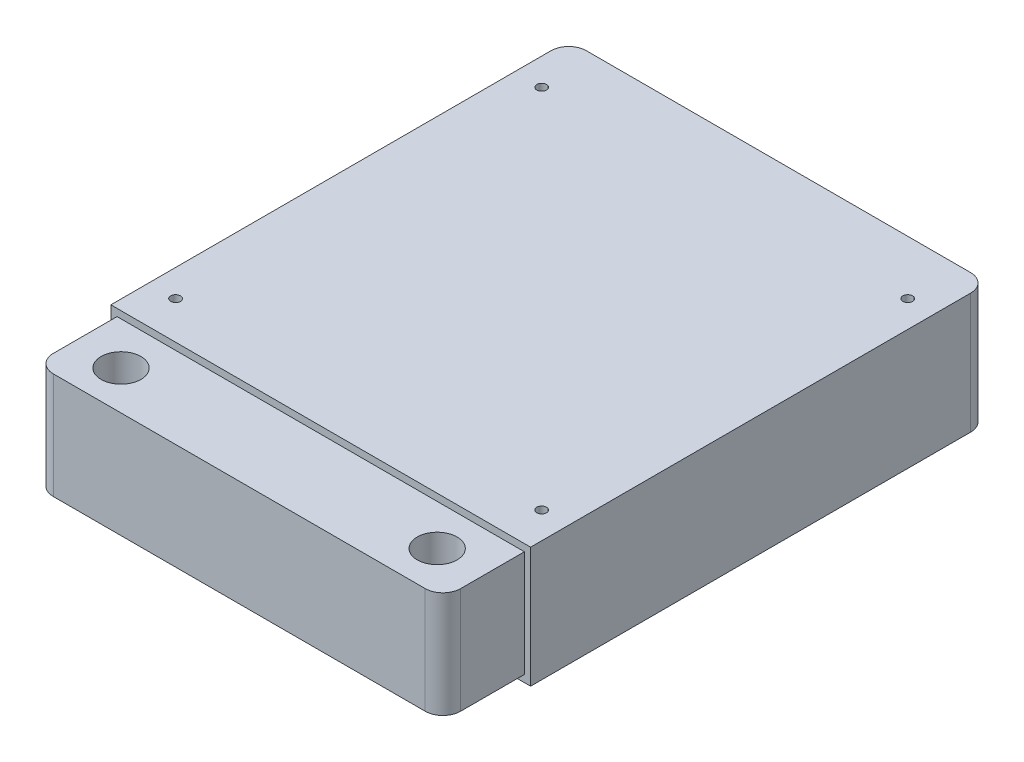
ISO-10303-21;
HEADER;
FILE_DESCRIPTION(('STEP AP214'),'2;1');
FILE_NAME('part.step','',(''),(''),'','','');
FILE_SCHEMA(('AUTOMOTIVE_DESIGN { 1 0 10303 214 1 1 1 1 }'));
ENDSEC;
DATA;
#1=APPLICATION_CONTEXT('core data for automotive mechanical design processes');
#2=APPLICATION_PROTOCOL_DEFINITION('international standard','automotive_design',2000,#1);
#3=PRODUCT_CONTEXT('',#1,'mechanical');
#4=PRODUCT('Part','Part','',(#3));
#5=PRODUCT_RELATED_PRODUCT_CATEGORY('part','',(#4));
#6=PRODUCT_DEFINITION_FORMATION('','',#4);
#7=PRODUCT_DEFINITION_CONTEXT('part definition',#1,'design');
#8=PRODUCT_DEFINITION('design','',#6,#7);
#9=PRODUCT_DEFINITION_SHAPE('','',#8);
#10=(LENGTH_UNIT() NAMED_UNIT(*) SI_UNIT(.MILLI.,.METRE.));
#11=(NAMED_UNIT(*) PLANE_ANGLE_UNIT() SI_UNIT($,.RADIAN.));
#12=(NAMED_UNIT(*) SI_UNIT($,.STERADIAN.) SOLID_ANGLE_UNIT());
#13=UNCERTAINTY_MEASURE_WITH_UNIT(LENGTH_MEASURE(1.E-05),#10,'distance_accuracy_value','');
#14=(GEOMETRIC_REPRESENTATION_CONTEXT(3) GLOBAL_UNCERTAINTY_ASSIGNED_CONTEXT((#13)) GLOBAL_UNIT_ASSIGNED_CONTEXT((#10,
#11,#12)) REPRESENTATION_CONTEXT('',''));
#15=CARTESIAN_POINT('',(0.,0.,0.));
#16=DIRECTION('',(0.,0.,1.));
#17=DIRECTION('',(1.,0.,0.));
#18=AXIS2_PLACEMENT_3D('',#15,#16,#17);
#19=CARTESIAN_POINT('',(-143.433647385571,34.544,12.0931673151752));
#20=DIRECTION('',(0.,0.,-1.));
#21=DIRECTION('',(-1.,0.,0.));
#22=AXIS2_PLACEMENT_3D('',#19,#20,#21);
#23=PLANE('',#22);
#24=DIRECTION('',(1.,0.,0.));
#25=VECTOR('',#24,1.);
#26=CARTESIAN_POINT('',(-143.433647385571,0.,12.0931673151752));
#27=LINE('',#26,#25);
#28=CARTESIAN_POINT('',(-143.433647385571,0.,12.0931673151752));
#29=VERTEX_POINT('',#28);
#30=CARTESIAN_POINT('',(-23.0376473855714,0.,12.0931673151752));
#31=VERTEX_POINT('',#30);
#32=EDGE_CURVE('E189',#29,#31,#27,.T.);
#33=ORIENTED_EDGE('',*,*,#32,.T.);
#34=DIRECTION('',(0.,-1.,0.));
#35=VECTOR('',#34,1.);
#36=CARTESIAN_POINT('',(-23.0376473855714,34.544,12.0931673151752));
#37=LINE('',#36,#35);
#38=CARTESIAN_POINT('',(-23.0376473855714,34.544,12.0931673151752));
#39=VERTEX_POINT('',#38);
#40=EDGE_CURVE('E196',#39,#31,#37,.T.);
#41=ORIENTED_EDGE('',*,*,#40,.F.);
#42=DIRECTION('',(1.,0.,0.));
#43=VECTOR('',#42,1.);
#44=CARTESIAN_POINT('',(-143.433647385571,34.544,12.0931673151752));
#45=LINE('',#44,#43);
#46=CARTESIAN_POINT('',(-143.433647385571,34.544,12.0931673151752));
#47=VERTEX_POINT('',#46);
#48=EDGE_CURVE('E194',#47,#39,#45,.T.);
#49=ORIENTED_EDGE('',*,*,#48,.F.);
#50=DIRECTION('',(0.,-1.,0.));
#51=VECTOR('',#50,1.);
#52=CARTESIAN_POINT('',(-143.433647385571,34.544,12.0931673151752));
#53=LINE('',#52,#51);
#54=EDGE_CURVE('E207',#47,#29,#53,.T.);
#55=ORIENTED_EDGE('',*,*,#54,.T.);
#56=EDGE_LOOP('',(#33,#41,#49,#55));
#57=FACE_BOUND('',#56,.T.);
#58=DIRECTION('',(0.,1.,0.));
#59=VECTOR('',#58,1.);
#60=CARTESIAN_POINT('',(-24.8156473855714,2.032,12.0931673151752));
#61=LINE('',#60,#59);
#62=CARTESIAN_POINT('',(-24.8156473855714,2.032,12.0931673151752));
#63=VERTEX_POINT('',#62);
#64=CARTESIAN_POINT('',(-24.8156473855714,32.512,12.0931673151752));
#65=VERTEX_POINT('',#64);
#66=EDGE_CURVE('E127',#63,#65,#61,.T.);
#67=ORIENTED_EDGE('',*,*,#66,.F.);
#68=DIRECTION('',(1.,0.,0.));
#69=VECTOR('',#68,1.);
#70=CARTESIAN_POINT('',(-141.655647385571,2.032,12.0931673151752));
#71=LINE('',#70,#69);
#72=CARTESIAN_POINT('',(-141.655647385571,2.032,12.0931673151752));
#73=VERTEX_POINT('',#72);
#74=EDGE_CURVE('E139',#73,#63,#71,.T.);
#75=ORIENTED_EDGE('',*,*,#74,.F.);
#76=DIRECTION('',(0.,-1.,0.));
#77=VECTOR('',#76,1.);
#78=CARTESIAN_POINT('',(-141.655647385571,2.032,12.0931673151752));
#79=LINE('',#78,#77);
#80=CARTESIAN_POINT('',(-141.655647385571,32.512,12.0931673151752));
#81=VERTEX_POINT('',#80);
#82=EDGE_CURVE('E148',#81,#73,#79,.T.);
#83=ORIENTED_EDGE('',*,*,#82,.F.);
#84=DIRECTION('',(-1.,0.,0.));
#85=VECTOR('',#84,1.);
#86=CARTESIAN_POINT('',(-141.655647385571,32.512,12.0931673151752));
#87=LINE('',#86,#85);
#88=EDGE_CURVE('E142',#65,#81,#87,.T.);
#89=ORIENTED_EDGE('',*,*,#88,.F.);
#90=EDGE_LOOP('',(#67,#75,#83,#89));
#91=FACE_BOUND('',#90,.T.);
#92=ADVANCED_FACE('F35',(#57,#91),#23,.F.);
#93=CARTESIAN_POINT('',(-23.0376473855714,34.544,-119.224832684825));
#94=DIRECTION('',(-1.,0.,0.));
#95=DIRECTION('',(0.,0.,1.));
#96=AXIS2_PLACEMENT_3D('',#93,#94,#95);
#97=PLANE('',#96);
#98=DIRECTION('',(0.,0.,-1.));
#99=VECTOR('',#98,1.);
#100=CARTESIAN_POINT('',(-23.0376473855714,0.,-119.224832684825));
#101=LINE('',#100,#99);
#102=CARTESIAN_POINT('',(-23.0376473855714,0.,-114.144832684825));
#103=VERTEX_POINT('',#102);
#104=EDGE_CURVE('E182',#31,#103,#101,.T.);
#105=ORIENTED_EDGE('',*,*,#104,.T.);
#106=DIRECTION('',(0.,-1.,0.));
#107=VECTOR('',#106,1.);
#108=CARTESIAN_POINT('',(-23.0376473855714,34.544,-114.144832684825));
#109=LINE('',#108,#107);
#110=CARTESIAN_POINT('',(-23.0376473855714,34.544,-114.144832684825));
#111=VERTEX_POINT('',#110);
#112=EDGE_CURVE('E226',#103,#111,#109,.F.);
#113=ORIENTED_EDGE('',*,*,#112,.T.);
#114=DIRECTION('',(0.,0.,-1.));
#115=VECTOR('',#114,1.);
#116=CARTESIAN_POINT('',(-23.0376473855714,34.544,-119.224832684825));
#117=LINE('',#116,#115);
#118=EDGE_CURVE('E185',#39,#111,#117,.T.);
#119=ORIENTED_EDGE('',*,*,#118,.F.);
#120=ORIENTED_EDGE('',*,*,#40,.T.);
#121=EDGE_LOOP('',(#105,#113,#119,#120));
#122=FACE_BOUND('',#121,.T.);
#123=ADVANCED_FACE('F287',(#122),#97,.F.);
#124=CARTESIAN_POINT('',(-143.433647385571,34.544,-119.224832684825));
#125=DIRECTION('',(0.,0.,1.));
#126=DIRECTION('',(1.,0.,0.));
#127=AXIS2_PLACEMENT_3D('',#124,#125,#126);
#128=PLANE('',#127);
#129=DIRECTION('',(-1.,0.,0.));
#130=VECTOR('',#129,1.);
#131=CARTESIAN_POINT('',(-143.433647385571,34.544,-119.224832684825));
#132=LINE('',#131,#130);
#133=CARTESIAN_POINT('',(-28.1176473855715,34.544,-119.224832684825));
#134=VERTEX_POINT('',#133);
#135=CARTESIAN_POINT('',(-138.353647385571,34.544,-119.224832684825));
#136=VERTEX_POINT('',#135);
#137=EDGE_CURVE('E188',#134,#136,#132,.T.);
#138=ORIENTED_EDGE('',*,*,#137,.F.);
#139=DIRECTION('',(0.,-1.,0.));
#140=VECTOR('',#139,1.);
#141=CARTESIAN_POINT('',(-28.1176473855714,34.544,-119.224832684825));
#142=LINE('',#141,#140);
#143=CARTESIAN_POINT('',(-28.1176473855715,0.,-119.224832684825));
#144=VERTEX_POINT('',#143);
#145=EDGE_CURVE('E219',#134,#144,#142,.T.);
#146=ORIENTED_EDGE('',*,*,#145,.T.);
#147=DIRECTION('',(-1.,0.,0.));
#148=VECTOR('',#147,1.);
#149=CARTESIAN_POINT('',(-143.433647385571,0.,-119.224832684825));
#150=LINE('',#149,#148);
#151=CARTESIAN_POINT('',(-138.353647385571,0.,-119.224832684825));
#152=VERTEX_POINT('',#151);
#153=EDGE_CURVE('E199',#144,#152,#150,.T.);
#154=ORIENTED_EDGE('',*,*,#153,.T.);
#155=DIRECTION('',(0.,-1.,0.));
#156=VECTOR('',#155,1.);
#157=CARTESIAN_POINT('',(-138.353647385571,34.544,-119.224832684825));
#158=LINE('',#157,#156);
#159=EDGE_CURVE('E210',#152,#136,#158,.F.);
#160=ORIENTED_EDGE('',*,*,#159,.T.);
#161=EDGE_LOOP('',(#138,#146,#154,#160));
#162=FACE_BOUND('',#161,.T.);
#163=ADVANCED_FACE('F293',(#162),#128,.F.);
#164=CARTESIAN_POINT('',(-143.433647385571,34.544,-119.224832684825));
#165=DIRECTION('',(1.,0.,0.));
#166=DIRECTION('',(0.,0.,-1.));
#167=AXIS2_PLACEMENT_3D('',#164,#165,#166);
#168=PLANE('',#167);
#169=DIRECTION('',(0.,0.,1.));
#170=VECTOR('',#169,1.);
#171=CARTESIAN_POINT('',(-143.433647385571,34.544,-119.224832684825));
#172=LINE('',#171,#170);
#173=CARTESIAN_POINT('',(-143.433647385571,34.544,-114.144832684825));
#174=VERTEX_POINT('',#173);
#175=EDGE_CURVE('E192',#174,#47,#172,.T.);
#176=ORIENTED_EDGE('',*,*,#175,.F.);
#177=DIRECTION('',(0.,-1.,0.));
#178=VECTOR('',#177,1.);
#179=CARTESIAN_POINT('',(-143.433647385571,34.544,-114.144832684825));
#180=LINE('',#179,#178);
#181=CARTESIAN_POINT('',(-143.433647385571,0.,-114.144832684825));
#182=VERTEX_POINT('',#181);
#183=EDGE_CURVE('E232',#174,#182,#180,.T.);
#184=ORIENTED_EDGE('',*,*,#183,.T.);
#185=DIRECTION('',(0.,0.,1.));
#186=VECTOR('',#185,1.);
#187=CARTESIAN_POINT('',(-143.433647385571,0.,-119.224832684825));
#188=LINE('',#187,#186);
#189=EDGE_CURVE('E202',#182,#29,#188,.T.);
#190=ORIENTED_EDGE('',*,*,#189,.T.);
#191=ORIENTED_EDGE('',*,*,#54,.F.);
#192=EDGE_LOOP('',(#176,#184,#190,#191));
#193=FACE_BOUND('',#192,.T.);
#194=ADVANCED_FACE('F300',(#193),#168,.F.);
#195=CARTESIAN_POINT('',(0.,34.544,0.));
#196=DIRECTION('',(0.,1.,0.));
#197=DIRECTION('',(0.,0.,1.));
#198=AXIS2_PLACEMENT_3D('',#195,#196,#197);
#199=PLANE('',#198);
#200=CARTESIAN_POINT('',(-30.6866473855714,34.544,-103.730832684825));
#201=DIRECTION('',(0.,1.,0.));
#202=DIRECTION('',(0.,0.,1.));
#203=AXIS2_PLACEMENT_3D('',#200,#201,#202);
#204=CIRCLE('',#203,1.397);
#205=CARTESIAN_POINT('',(-30.6866473855714,34.544,-102.333832684825));
#206=VERTEX_POINT('',#205);
#207=EDGE_CURVE('E165',#206,#206,#204,.T.);
#208=ORIENTED_EDGE('',*,*,#207,.F.);
#209=EDGE_LOOP('',(#208));
#210=FACE_BOUND('',#209,.T.);
#211=CARTESIAN_POINT('',(-135.686647385571,34.544,1.26916731517515));
#212=DIRECTION('',(0.,1.,0.));
#213=DIRECTION('',(0.,0.,1.));
#214=AXIS2_PLACEMENT_3D('',#211,#212,#213);
#215=CIRCLE('',#214,1.39700000000002);
#216=CARTESIAN_POINT('',(-135.686647385571,34.544,2.66616731517517));
#217=VERTEX_POINT('',#216);
#218=EDGE_CURVE('E171',#217,#217,#215,.T.);
#219=ORIENTED_EDGE('',*,*,#218,.F.);
#220=EDGE_LOOP('',(#219));
#221=FACE_BOUND('',#220,.T.);
#222=CARTESIAN_POINT('',(-30.6866473275714,34.544,1.26916731517515));
#223=DIRECTION('',(0.,1.,0.));
#224=DIRECTION('',(0.,0.,1.));
#225=AXIS2_PLACEMENT_3D('',#222,#223,#224);
#226=CIRCLE('',#225,1.397);
#227=CARTESIAN_POINT('',(-30.6866473275714,34.544,2.66616731517515));
#228=VERTEX_POINT('',#227);
#229=EDGE_CURVE('E160',#228,#228,#226,.T.);
#230=ORIENTED_EDGE('',*,*,#229,.F.);
#231=EDGE_LOOP('',(#230));
#232=FACE_BOUND('',#231,.T.);
#233=CARTESIAN_POINT('',(-135.686647385571,34.544,-103.730832684825));
#234=DIRECTION('',(0.,1.,0.));
#235=DIRECTION('',(0.,0.,1.));
#236=AXIS2_PLACEMENT_3D('',#233,#234,#235);
#237=CIRCLE('',#236,1.39700000000002);
#238=CARTESIAN_POINT('',(-135.686647385571,34.544,-102.333832684825));
#239=VERTEX_POINT('',#238);
#240=EDGE_CURVE('E164',#239,#239,#237,.T.);
#241=ORIENTED_EDGE('',*,*,#240,.F.);
#242=EDGE_LOOP('',(#241));
#243=FACE_BOUND('',#242,.T.);
#244=ORIENTED_EDGE('',*,*,#118,.T.);
#245=CARTESIAN_POINT('',(-28.1176473855714,34.544,-114.144832684825));
#246=DIRECTION('',(0.,1.,0.));
#247=DIRECTION('',(0.,0.,1.));
#248=AXIS2_PLACEMENT_3D('',#245,#246,#247);
#249=CIRCLE('',#248,5.08);
#250=EDGE_CURVE('E230',#111,#134,#249,.T.);
#251=ORIENTED_EDGE('',*,*,#250,.T.);
#252=ORIENTED_EDGE('',*,*,#137,.T.);
#253=CARTESIAN_POINT('',(-138.353647385571,34.544,-114.144832684825));
#254=DIRECTION('',(0.,1.,0.));
#255=DIRECTION('',(0.,0.,1.));
#256=AXIS2_PLACEMENT_3D('',#253,#254,#255);
#257=CIRCLE('',#256,5.08);
#258=EDGE_CURVE('E228',#136,#174,#257,.T.);
#259=ORIENTED_EDGE('',*,*,#258,.T.);
#260=ORIENTED_EDGE('',*,*,#175,.T.);
#261=ORIENTED_EDGE('',*,*,#48,.T.);
#262=EDGE_LOOP('',(#244,#251,#252,#259,#260,#261));
#263=FACE_BOUND('',#262,.T.);
#264=ADVANCED_FACE('F303',(#210,#221,#232,#243,#263),#199,.T.);
#265=CARTESIAN_POINT('',(0.,0.,0.));
#266=DIRECTION('',(0.,1.,0.));
#267=DIRECTION('',(0.,0.,1.));
#268=AXIS2_PLACEMENT_3D('',#265,#266,#267);
#269=PLANE('',#268);
#270=CARTESIAN_POINT('',(-30.6866473855714,0.,-103.730832684825));
#271=DIRECTION('',(0.,1.,0.));
#272=DIRECTION('',(0.,0.,1.));
#273=AXIS2_PLACEMENT_3D('',#270,#271,#272);
#274=CIRCLE('',#273,1.397);
#275=CARTESIAN_POINT('',(-30.6866473855714,0.,-102.333832684825));
#276=VERTEX_POINT('',#275);
#277=EDGE_CURVE('E161',#276,#276,#274,.T.);
#278=ORIENTED_EDGE('',*,*,#277,.T.);
#279=EDGE_LOOP('',(#278));
#280=FACE_BOUND('',#279,.T.);
#281=CARTESIAN_POINT('',(-135.686647385571,0.,1.26916731517515));
#282=DIRECTION('',(0.,1.,0.));
#283=DIRECTION('',(0.,0.,1.));
#284=AXIS2_PLACEMENT_3D('',#281,#282,#283);
#285=CIRCLE('',#284,1.39700000000002);
#286=CARTESIAN_POINT('',(-135.686647385571,0.,2.66616731517517));
#287=VERTEX_POINT('',#286);
#288=EDGE_CURVE('E168',#287,#287,#285,.T.);
#289=ORIENTED_EDGE('',*,*,#288,.T.);
#290=EDGE_LOOP('',(#289));
#291=FACE_BOUND('',#290,.T.);
#292=CARTESIAN_POINT('',(-30.6866473275714,0.,1.26916731517515));
#293=DIRECTION('',(0.,1.,0.));
#294=DIRECTION('',(0.,0.,1.));
#295=AXIS2_PLACEMENT_3D('',#292,#293,#294);
#296=CIRCLE('',#295,1.397);
#297=CARTESIAN_POINT('',(-30.6866473275714,0.,2.66616731517515));
#298=VERTEX_POINT('',#297);
#299=EDGE_CURVE('E174',#298,#298,#296,.T.);
#300=ORIENTED_EDGE('',*,*,#299,.T.);
#301=EDGE_LOOP('',(#300));
#302=FACE_BOUND('',#301,.T.);
#303=CARTESIAN_POINT('',(-135.686647385571,0.,-103.730832684825));
#304=DIRECTION('',(0.,1.,0.));
#305=DIRECTION('',(0.,0.,1.));
#306=AXIS2_PLACEMENT_3D('',#303,#304,#305);
#307=CIRCLE('',#306,1.39700000000002);
#308=CARTESIAN_POINT('',(-135.686647385571,0.,-102.333832684825));
#309=VERTEX_POINT('',#308);
#310=EDGE_CURVE('E179',#309,#309,#307,.T.);
#311=ORIENTED_EDGE('',*,*,#310,.T.);
#312=EDGE_LOOP('',(#311));
#313=FACE_BOUND('',#312,.T.);
#314=ORIENTED_EDGE('',*,*,#153,.F.);
#315=CARTESIAN_POINT('',(-28.1176473855714,0.,-114.144832684825));
#316=DIRECTION('',(0.,1.,0.));
#317=DIRECTION('',(0.,0.,1.));
#318=AXIS2_PLACEMENT_3D('',#315,#316,#317);
#319=CIRCLE('',#318,5.08);
#320=EDGE_CURVE('E224',#144,#103,#319,.F.);
#321=ORIENTED_EDGE('',*,*,#320,.T.);
#322=ORIENTED_EDGE('',*,*,#104,.F.);
#323=ORIENTED_EDGE('',*,*,#32,.F.);
#324=ORIENTED_EDGE('',*,*,#189,.F.);
#325=CARTESIAN_POINT('',(-138.353647385571,0.,-114.144832684825));
#326=DIRECTION('',(0.,1.,0.));
#327=DIRECTION('',(0.,0.,1.));
#328=AXIS2_PLACEMENT_3D('',#325,#326,#327);
#329=CIRCLE('',#328,5.08);
#330=EDGE_CURVE('E222',#182,#152,#329,.F.);
#331=ORIENTED_EDGE('',*,*,#330,.T.);
#332=EDGE_LOOP('',(#314,#321,#322,#323,#324,#331));
#333=FACE_BOUND('',#332,.T.);
#334=ADVANCED_FACE('F298',(#280,#291,#302,#313,#333),#269,.F.);
#335=CARTESIAN_POINT('',(-135.686647385571,0.,-103.730832684825));
#336=DIRECTION('',(0.,1.,0.));
#337=DIRECTION('',(0.,0.,1.));
#338=AXIS2_PLACEMENT_3D('',#335,#336,#337);
#339=CYLINDRICAL_SURFACE('',#338,1.39700000000002);
#340=ORIENTED_EDGE('',*,*,#310,.F.);
#341=EDGE_LOOP('',(#340));
#342=FACE_BOUND('',#341,.T.);
#343=ORIENTED_EDGE('',*,*,#240,.T.);
#344=EDGE_LOOP('',(#343));
#345=FACE_BOUND('',#344,.T.);
#346=ADVANCED_FACE('F383',(#342,#345),#339,.F.);
#347=CARTESIAN_POINT('',(-30.6866473275714,0.,1.26916731517515));
#348=DIRECTION('',(0.,1.,0.));
#349=DIRECTION('',(0.,0.,1.));
#350=AXIS2_PLACEMENT_3D('',#347,#348,#349);
#351=CYLINDRICAL_SURFACE('',#350,1.397);
#352=ORIENTED_EDGE('',*,*,#299,.F.);
#353=EDGE_LOOP('',(#352));
#354=FACE_BOUND('',#353,.T.);
#355=ORIENTED_EDGE('',*,*,#229,.T.);
#356=EDGE_LOOP('',(#355));
#357=FACE_BOUND('',#356,.T.);
#358=ADVANCED_FACE('F443',(#354,#357),#351,.F.);
#359=CARTESIAN_POINT('',(-135.686647385571,0.,1.26916731517515));
#360=DIRECTION('',(0.,1.,0.));
#361=DIRECTION('',(0.,0.,1.));
#362=AXIS2_PLACEMENT_3D('',#359,#360,#361);
#363=CYLINDRICAL_SURFACE('',#362,1.39700000000002);
#364=ORIENTED_EDGE('',*,*,#288,.F.);
#365=EDGE_LOOP('',(#364));
#366=FACE_BOUND('',#365,.T.);
#367=ORIENTED_EDGE('',*,*,#218,.T.);
#368=EDGE_LOOP('',(#367));
#369=FACE_BOUND('',#368,.T.);
#370=ADVANCED_FACE('F433',(#366,#369),#363,.F.);
#371=CARTESIAN_POINT('',(-30.6866473855714,0.,-103.730832684825));
#372=DIRECTION('',(0.,1.,0.));
#373=DIRECTION('',(0.,0.,1.));
#374=AXIS2_PLACEMENT_3D('',#371,#372,#373);
#375=CYLINDRICAL_SURFACE('',#374,1.397);
#376=ORIENTED_EDGE('',*,*,#277,.F.);
#377=EDGE_LOOP('',(#376));
#378=FACE_BOUND('',#377,.T.);
#379=ORIENTED_EDGE('',*,*,#207,.T.);
#380=EDGE_LOOP('',(#379));
#381=FACE_BOUND('',#380,.T.);
#382=ADVANCED_FACE('F372',(#378,#381),#375,.F.);
#383=CARTESIAN_POINT('',(-24.8156473855714,2.032,35.4611673151752));
#384=DIRECTION('',(-1.,0.,0.));
#385=DIRECTION('',(0.,0.,1.));
#386=AXIS2_PLACEMENT_3D('',#383,#384,#385);
#387=PLANE('',#386);
#388=DIRECTION('',(0.,0.,-1.));
#389=VECTOR('',#388,1.);
#390=CARTESIAN_POINT('',(-24.8156473855714,32.512,35.4611673151752));
#391=LINE('',#390,#389);
#392=CARTESIAN_POINT('',(-24.8156473855714,32.512,30.3811673151752));
#393=VERTEX_POINT('',#392);
#394=EDGE_CURVE('E158',#393,#65,#391,.T.);
#395=ORIENTED_EDGE('',*,*,#394,.F.);
#396=DIRECTION('',(0.,1.,0.));
#397=VECTOR('',#396,1.);
#398=CARTESIAN_POINT('',(-24.8156473855714,2.032,30.3811673151752));
#399=LINE('',#398,#397);
#400=CARTESIAN_POINT('',(-24.8156473855714,2.032,30.3811673151752));
#401=VERTEX_POINT('',#400);
#402=EDGE_CURVE('E11',#393,#401,#399,.F.);
#403=ORIENTED_EDGE('',*,*,#402,.T.);
#404=DIRECTION('',(0.,0.,-1.));
#405=VECTOR('',#404,1.);
#406=CARTESIAN_POINT('',(-24.8156473855714,2.032,35.4611673151752));
#407=LINE('',#406,#405);
#408=EDGE_CURVE('E124',#401,#63,#407,.T.);
#409=ORIENTED_EDGE('',*,*,#408,.T.);
#410=ORIENTED_EDGE('',*,*,#66,.T.);
#411=EDGE_LOOP('',(#395,#403,#409,#410));
#412=FACE_BOUND('',#411,.T.);
#413=ADVANCED_FACE('F126',(#412),#387,.F.);
#414=CARTESIAN_POINT('',(-141.655647385571,32.512,35.4611673151752));
#415=DIRECTION('',(0.,-1.,0.));
#416=DIRECTION('',(0.,0.,-1.));
#417=AXIS2_PLACEMENT_3D('',#414,#415,#416);
#418=PLANE('',#417);
#419=CARTESIAN_POINT('',(-38.1506473855714,32.512,23.7771673151752));
#420=DIRECTION('',(0.,1.,0.));
#421=DIRECTION('',(0.,0.,1.));
#422=AXIS2_PLACEMENT_3D('',#419,#420,#421);
#423=CIRCLE('',#422,5.715);
#424=CARTESIAN_POINT('',(-38.1506473855714,32.512,29.4921673151751));
#425=VERTEX_POINT('',#424);
#426=EDGE_CURVE('E217',#425,#425,#423,.T.);
#427=ORIENTED_EDGE('',*,*,#426,.F.);
#428=EDGE_LOOP('',(#427));
#429=FACE_BOUND('',#428,.T.);
#430=CARTESIAN_POINT('',(-128.320647385571,32.512,24.2881986543503));
#431=DIRECTION('',(0.,1.,0.));
#432=DIRECTION('',(0.,0.,1.));
#433=AXIS2_PLACEMENT_3D('',#430,#431,#432);
#434=CIRCLE('',#433,5.71499999999999);
#435=CARTESIAN_POINT('',(-128.320647385571,32.512,30.0031986543503));
#436=VERTEX_POINT('',#435);
#437=EDGE_CURVE('E213',#436,#436,#434,.T.);
#438=ORIENTED_EDGE('',*,*,#437,.F.);
#439=EDGE_LOOP('',(#438));
#440=FACE_BOUND('',#439,.T.);
#441=DIRECTION('',(0.,0.,-1.));
#442=VECTOR('',#441,1.);
#443=CARTESIAN_POINT('',(-141.655647385571,32.512,35.4611673151752));
#444=LINE('',#443,#442);
#445=CARTESIAN_POINT('',(-141.655647385571,32.512,30.3811673151752));
#446=VERTEX_POINT('',#445);
#447=EDGE_CURVE('E156',#446,#81,#444,.T.);
#448=ORIENTED_EDGE('',*,*,#447,.F.);
#449=CARTESIAN_POINT('',(-136.575647385571,32.512,30.3811673151752));
#450=DIRECTION('',(0.,-1.,0.));
#451=DIRECTION('',(0.,0.,-1.));
#452=AXIS2_PLACEMENT_3D('',#449,#450,#451);
#453=CIRCLE('',#452,5.08);
#454=CARTESIAN_POINT('',(-136.575647385571,32.512,35.4611673151752));
#455=VERTEX_POINT('',#454);
#456=EDGE_CURVE('E43',#446,#455,#453,.F.);
#457=ORIENTED_EDGE('',*,*,#456,.T.);
#458=DIRECTION('',(-1.,0.,0.));
#459=VECTOR('',#458,1.);
#460=CARTESIAN_POINT('',(-141.655647385571,32.512,35.4611673151752));
#461=LINE('',#460,#459);
#462=CARTESIAN_POINT('',(-29.8956473855714,32.512,35.4611673151752));
#463=VERTEX_POINT('',#462);
#464=EDGE_CURVE('E147',#463,#455,#461,.T.);
#465=ORIENTED_EDGE('',*,*,#464,.F.);
#466=CARTESIAN_POINT('',(-29.8956473855714,32.512,30.3811673151752));
#467=DIRECTION('',(0.,-1.,0.));
#468=DIRECTION('',(0.,0.,-1.));
#469=AXIS2_PLACEMENT_3D('',#466,#467,#468);
#470=CIRCLE('',#469,5.08);
#471=EDGE_CURVE('E50',#463,#393,#470,.F.);
#472=ORIENTED_EDGE('',*,*,#471,.T.);
#473=ORIENTED_EDGE('',*,*,#394,.T.);
#474=ORIENTED_EDGE('',*,*,#88,.T.);
#475=EDGE_LOOP('',(#448,#457,#465,#472,#473,#474));
#476=FACE_BOUND('',#475,.T.);
#477=ADVANCED_FACE('F247',(#429,#440,#476),#418,.F.);
#478=CARTESIAN_POINT('',(-141.655647385571,2.032,35.4611673151752));
#479=DIRECTION('',(1.,0.,0.));
#480=DIRECTION('',(0.,0.,-1.));
#481=AXIS2_PLACEMENT_3D('',#478,#479,#480);
#482=PLANE('',#481);
#483=DIRECTION('',(0.,0.,-1.));
#484=VECTOR('',#483,1.);
#485=CARTESIAN_POINT('',(-141.655647385571,2.032,35.4611673151752));
#486=LINE('',#485,#484);
#487=CARTESIAN_POINT('',(-141.655647385571,2.032,30.3811673151752));
#488=VERTEX_POINT('',#487);
#489=EDGE_CURVE('E132',#488,#73,#486,.T.);
#490=ORIENTED_EDGE('',*,*,#489,.F.);
#491=DIRECTION('',(0.,-1.,0.));
#492=VECTOR('',#491,1.);
#493=CARTESIAN_POINT('',(-141.655647385571,2.032,30.3811673151752));
#494=LINE('',#493,#492);
#495=EDGE_CURVE('E58',#488,#446,#494,.F.);
#496=ORIENTED_EDGE('',*,*,#495,.T.);
#497=ORIENTED_EDGE('',*,*,#447,.T.);
#498=ORIENTED_EDGE('',*,*,#82,.T.);
#499=EDGE_LOOP('',(#490,#496,#497,#498));
#500=FACE_BOUND('',#499,.T.);
#501=ADVANCED_FACE('F255',(#500),#482,.F.);
#502=CARTESIAN_POINT('',(-141.655647385571,2.032,35.4611673151752));
#503=DIRECTION('',(0.,1.,0.));
#504=DIRECTION('',(0.,0.,1.));
#505=AXIS2_PLACEMENT_3D('',#502,#503,#504);
#506=PLANE('',#505);
#507=CARTESIAN_POINT('',(-38.1506473855714,2.032,23.7771673151752));
#508=DIRECTION('',(0.,1.,0.));
#509=DIRECTION('',(0.,0.,1.));
#510=AXIS2_PLACEMENT_3D('',#507,#508,#509);
#511=CIRCLE('',#510,5.715);
#512=CARTESIAN_POINT('',(-38.1506473855714,2.032,29.4921673151751));
#513=VERTEX_POINT('',#512);
#514=EDGE_CURVE('E214',#513,#513,#511,.T.);
#515=ORIENTED_EDGE('',*,*,#514,.T.);
#516=EDGE_LOOP('',(#515));
#517=FACE_BOUND('',#516,.T.);
#518=CARTESIAN_POINT('',(-128.320647385571,2.032,24.2881986543503));
#519=DIRECTION('',(0.,1.,0.));
#520=DIRECTION('',(0.,0.,1.));
#521=AXIS2_PLACEMENT_3D('',#518,#519,#520);
#522=CIRCLE('',#521,5.71499999999999);
#523=CARTESIAN_POINT('',(-128.320647385571,2.032,30.0031986543503));
#524=VERTEX_POINT('',#523);
#525=EDGE_CURVE('E143',#524,#524,#522,.T.);
#526=ORIENTED_EDGE('',*,*,#525,.T.);
#527=EDGE_LOOP('',(#526));
#528=FACE_BOUND('',#527,.T.);
#529=DIRECTION('',(1.,0.,0.));
#530=VECTOR('',#529,1.);
#531=CARTESIAN_POINT('',(-141.655647385571,2.032,35.4611673151752));
#532=LINE('',#531,#530);
#533=CARTESIAN_POINT('',(-136.575647385571,2.032,35.4611673151752));
#534=VERTEX_POINT('',#533);
#535=CARTESIAN_POINT('',(-29.8956473855714,2.032,35.4611673151752));
#536=VERTEX_POINT('',#535);
#537=EDGE_CURVE('E133',#534,#536,#532,.T.);
#538=ORIENTED_EDGE('',*,*,#537,.F.);
#539=CARTESIAN_POINT('',(-136.575647385571,2.032,30.3811673151752));
#540=DIRECTION('',(0.,1.,0.));
#541=DIRECTION('',(0.,0.,1.));
#542=AXIS2_PLACEMENT_3D('',#539,#540,#541);
#543=CIRCLE('',#542,5.08);
#544=EDGE_CURVE('E243',#534,#488,#543,.F.);
#545=ORIENTED_EDGE('',*,*,#544,.T.);
#546=ORIENTED_EDGE('',*,*,#489,.T.);
#547=ORIENTED_EDGE('',*,*,#74,.T.);
#548=ORIENTED_EDGE('',*,*,#408,.F.);
#549=CARTESIAN_POINT('',(-29.8956473855714,2.032,30.3811673151752));
#550=DIRECTION('',(0.,1.,0.));
#551=DIRECTION('',(0.,0.,1.));
#552=AXIS2_PLACEMENT_3D('',#549,#550,#551);
#553=CIRCLE('',#552,5.08);
#554=EDGE_CURVE('E241',#401,#536,#553,.F.);
#555=ORIENTED_EDGE('',*,*,#554,.T.);
#556=EDGE_LOOP('',(#538,#545,#546,#547,#548,#555));
#557=FACE_BOUND('',#556,.T.);
#558=ADVANCED_FACE('F146',(#517,#528,#557),#506,.F.);
#559=CARTESIAN_POINT('',(0.,0.,35.4611673151752));
#560=DIRECTION('',(0.,0.,-1.));
#561=DIRECTION('',(-1.,0.,0.));
#562=AXIS2_PLACEMENT_3D('',#559,#560,#561);
#563=PLANE('',#562);
#564=ORIENTED_EDGE('',*,*,#464,.T.);
#565=DIRECTION('',(0.,-1.,0.));
#566=VECTOR('',#565,1.);
#567=CARTESIAN_POINT('',(-136.575647385571,0.,35.4611673151752));
#568=LINE('',#567,#566);
#569=EDGE_CURVE('E238',#455,#534,#568,.T.);
#570=ORIENTED_EDGE('',*,*,#569,.T.);
#571=ORIENTED_EDGE('',*,*,#537,.T.);
#572=DIRECTION('',(0.,1.,0.));
#573=VECTOR('',#572,1.);
#574=CARTESIAN_POINT('',(-29.8956473855714,0.,35.4611673151752));
#575=LINE('',#574,#573);
#576=EDGE_CURVE('E235',#536,#463,#575,.T.);
#577=ORIENTED_EDGE('',*,*,#576,.T.);
#578=EDGE_LOOP('',(#564,#570,#571,#577));
#579=FACE_BOUND('',#578,.T.);
#580=ADVANCED_FACE('F251',(#579),#563,.F.);
#581=CARTESIAN_POINT('',(-128.320647385571,0.,24.2881986543503));
#582=DIRECTION('',(0.,1.,0.));
#583=DIRECTION('',(0.,0.,1.));
#584=AXIS2_PLACEMENT_3D('',#581,#582,#583);
#585=CYLINDRICAL_SURFACE('',#584,5.71499999999999);
#586=ORIENTED_EDGE('',*,*,#437,.T.);
#587=EDGE_LOOP('',(#586));
#588=FACE_BOUND('',#587,.T.);
#589=ORIENTED_EDGE('',*,*,#525,.F.);
#590=EDGE_LOOP('',(#589));
#591=FACE_BOUND('',#590,.T.);
#592=ADVANCED_FACE('F271',(#588,#591),#585,.F.);
#593=CARTESIAN_POINT('',(-38.1506473855714,0.,23.7771673151752));
#594=DIRECTION('',(0.,1.,0.));
#595=DIRECTION('',(0.,0.,1.));
#596=AXIS2_PLACEMENT_3D('',#593,#594,#595);
#597=CYLINDRICAL_SURFACE('',#596,5.715);
#598=ORIENTED_EDGE('',*,*,#426,.T.);
#599=EDGE_LOOP('',(#598));
#600=FACE_BOUND('',#599,.T.);
#601=ORIENTED_EDGE('',*,*,#514,.F.);
#602=EDGE_LOOP('',(#601));
#603=FACE_BOUND('',#602,.T.);
#604=ADVANCED_FACE('F263',(#600,#603),#597,.F.);
#605=CARTESIAN_POINT('',(-28.1176473855714,34.544,-114.144832684825));
#606=DIRECTION('',(0.,-1.,0.));
#607=DIRECTION('',(0.,0.,-1.));
#608=AXIS2_PLACEMENT_3D('',#605,#606,#607);
#609=CYLINDRICAL_SURFACE('',#608,5.08);
#610=ORIENTED_EDGE('',*,*,#250,.F.);
#611=ORIENTED_EDGE('',*,*,#112,.F.);
#612=ORIENTED_EDGE('',*,*,#320,.F.);
#613=ORIENTED_EDGE('',*,*,#145,.F.);
#614=EDGE_LOOP('',(#610,#611,#612,#613));
#615=FACE_BOUND('',#614,.T.);
#616=ADVANCED_FACE('F308',(#615),#609,.T.);
#617=CARTESIAN_POINT('',(-138.353647385571,34.544,-114.144832684825));
#618=DIRECTION('',(0.,-1.,0.));
#619=DIRECTION('',(0.,0.,-1.));
#620=AXIS2_PLACEMENT_3D('',#617,#618,#619);
#621=CYLINDRICAL_SURFACE('',#620,5.08);
#622=ORIENTED_EDGE('',*,*,#258,.F.);
#623=ORIENTED_EDGE('',*,*,#159,.F.);
#624=ORIENTED_EDGE('',*,*,#330,.F.);
#625=ORIENTED_EDGE('',*,*,#183,.F.);
#626=EDGE_LOOP('',(#622,#623,#624,#625));
#627=FACE_BOUND('',#626,.T.);
#628=ADVANCED_FACE('F311',(#627),#621,.T.);
#629=CARTESIAN_POINT('',(-136.575647385571,0.,30.3811673151752));
#630=DIRECTION('',(0.,-1.,0.));
#631=DIRECTION('',(0.,0.,-1.));
#632=AXIS2_PLACEMENT_3D('',#629,#630,#631);
#633=CYLINDRICAL_SURFACE('',#632,5.08);
#634=ORIENTED_EDGE('',*,*,#456,.F.);
#635=ORIENTED_EDGE('',*,*,#495,.F.);
#636=ORIENTED_EDGE('',*,*,#544,.F.);
#637=ORIENTED_EDGE('',*,*,#569,.F.);
#638=EDGE_LOOP('',(#634,#635,#636,#637));
#639=FACE_BOUND('',#638,.T.);
#640=ADVANCED_FACE('F254',(#639),#633,.T.);
#641=CARTESIAN_POINT('',(-29.8956473855714,0.,30.3811673151752));
#642=DIRECTION('',(0.,1.,0.));
#643=DIRECTION('',(0.,0.,1.));
#644=AXIS2_PLACEMENT_3D('',#641,#642,#643);
#645=CYLINDRICAL_SURFACE('',#644,5.08);
#646=ORIENTED_EDGE('',*,*,#554,.F.);
#647=ORIENTED_EDGE('',*,*,#402,.F.);
#648=ORIENTED_EDGE('',*,*,#471,.F.);
#649=ORIENTED_EDGE('',*,*,#576,.F.);
#650=EDGE_LOOP('',(#646,#647,#648,#649));
#651=FACE_BOUND('',#650,.T.);
#652=ADVANCED_FACE('F37',(#651),#645,.T.);
#653=CLOSED_SHELL('',(#92,#123,#163,#194,#264,#334,#346,#358,#370,#382,#413,#477,#501,#558,#580,
#592,#604,#616,#628,#640,#652));
#654=MANIFOLD_SOLID_BREP('B2',#653);
#655=ADVANCED_BREP_SHAPE_REPRESENTATION('',(#18,#654),#14);
#656=SHAPE_DEFINITION_REPRESENTATION(#9,#655);
ENDSEC;
END-ISO-10303-21;
